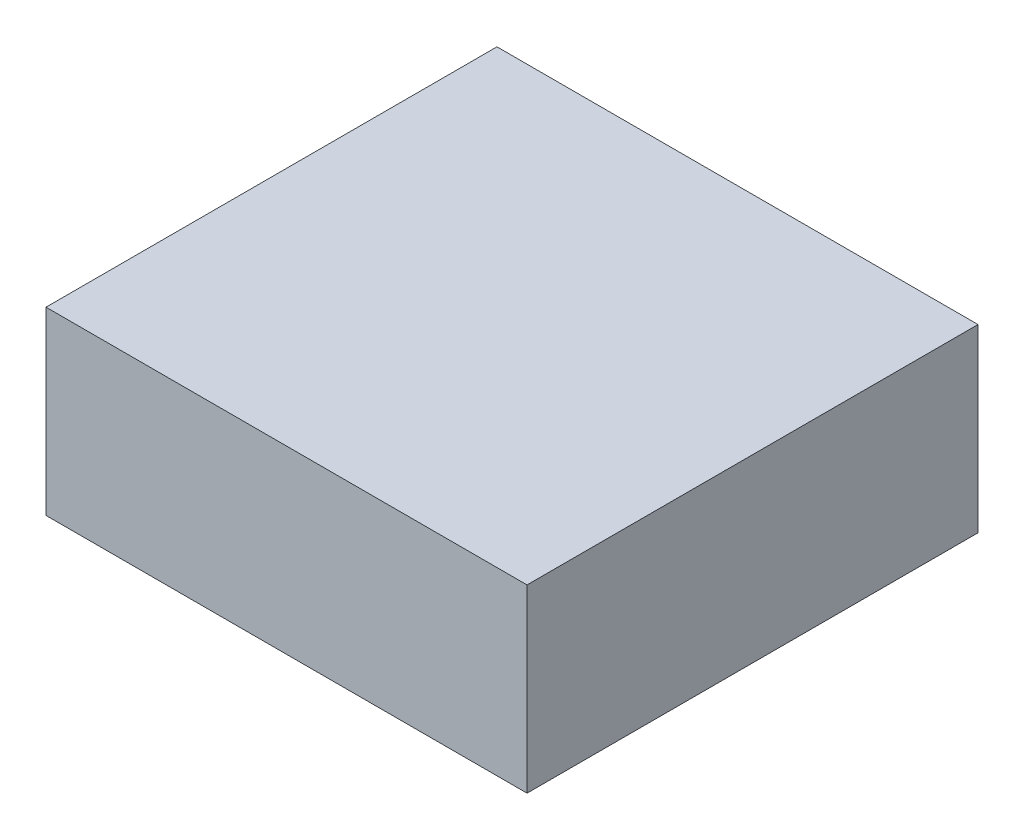
ISO-10303-21;
HEADER;
FILE_DESCRIPTION(('STEP AP214'),'2;1');
FILE_NAME('part.step','',(''),(''),'','','');
FILE_SCHEMA(('AUTOMOTIVE_DESIGN { 1 0 10303 214 1 1 1 1 }'));
ENDSEC;
DATA;
#1=APPLICATION_CONTEXT('core data for automotive mechanical design processes');
#2=APPLICATION_PROTOCOL_DEFINITION('international standard','automotive_design',2000,#1);
#3=PRODUCT_CONTEXT('',#1,'mechanical');
#4=PRODUCT('Part','Part','',(#3));
#5=PRODUCT_RELATED_PRODUCT_CATEGORY('part','',(#4));
#6=PRODUCT_DEFINITION_FORMATION('','',#4);
#7=PRODUCT_DEFINITION_CONTEXT('part definition',#1,'design');
#8=PRODUCT_DEFINITION('design','',#6,#7);
#9=PRODUCT_DEFINITION_SHAPE('','',#8);
#10=(LENGTH_UNIT() NAMED_UNIT(*) SI_UNIT(.MILLI.,.METRE.));
#11=(NAMED_UNIT(*) PLANE_ANGLE_UNIT() SI_UNIT($,.RADIAN.));
#12=(NAMED_UNIT(*) SI_UNIT($,.STERADIAN.) SOLID_ANGLE_UNIT());
#13=UNCERTAINTY_MEASURE_WITH_UNIT(LENGTH_MEASURE(1.E-05),#10,'distance_accuracy_value','');
#14=(GEOMETRIC_REPRESENTATION_CONTEXT(3) GLOBAL_UNCERTAINTY_ASSIGNED_CONTEXT((#13)) GLOBAL_UNIT_ASSIGNED_CONTEXT((#10,
#11,#12)) REPRESENTATION_CONTEXT('',''));
#15=CARTESIAN_POINT('',(0.,0.,0.));
#16=DIRECTION('',(0.,0.,1.));
#17=DIRECTION('',(1.,0.,0.));
#18=AXIS2_PLACEMENT_3D('',#15,#16,#17);
#19=CARTESIAN_POINT('',(-0.3999992,-0.1499997,0.));
#20=DIRECTION('',(0.,1.,0.));
#21=DIRECTION('',(0.,0.,1.));
#22=AXIS2_PLACEMENT_3D('',#19,#20,#21);
#23=PLANE('',#22);
#24=DIRECTION('',(0.,0.,1.));
#25=VECTOR('',#24,1.);
#26=CARTESIAN_POINT('',(0.40000174,-0.1499997,0.));
#27=LINE('',#26,#25);
#28=CARTESIAN_POINT('',(0.40000174,-0.1499997,0.));
#29=VERTEX_POINT('',#28);
#30=CARTESIAN_POINT('',(0.40000174,-0.1499997,0.75000104));
#31=VERTEX_POINT('',#30);
#32=EDGE_CURVE('E20',#29,#31,#27,.T.);
#33=ORIENTED_EDGE('',*,*,#32,.T.);
#34=DIRECTION('',(-1.,0.,0.));
#35=VECTOR('',#34,1.);
#36=CARTESIAN_POINT('',(0.40000174,-0.1499997,0.75000104));
#37=LINE('',#36,#35);
#38=CARTESIAN_POINT('',(-0.3999992,-0.1499997,0.75000104));
#39=VERTEX_POINT('',#38);
#40=EDGE_CURVE('E55',#31,#39,#37,.T.);
#41=ORIENTED_EDGE('',*,*,#40,.T.);
#42=DIRECTION('',(0.,0.,-1.));
#43=VECTOR('',#42,1.);
#44=CARTESIAN_POINT('',(-0.3999992,-0.1499997,0.));
#45=LINE('',#44,#43);
#46=CARTESIAN_POINT('',(-0.3999992,-0.1499997,0.));
#47=VERTEX_POINT('',#46);
#48=EDGE_CURVE('E76',#39,#47,#45,.T.);
#49=ORIENTED_EDGE('',*,*,#48,.T.);
#50=DIRECTION('',(-1.,0.,0.));
#51=VECTOR('',#50,1.);
#52=CARTESIAN_POINT('',(0.40000174,-0.1499997,0.));
#53=LINE('',#52,#51);
#54=EDGE_CURVE('E58',#29,#47,#53,.T.);
#55=ORIENTED_EDGE('',*,*,#54,.F.);
#56=EDGE_LOOP('',(#33,#41,#49,#55));
#57=FACE_BOUND('',#56,.T.);
#58=ADVANCED_FACE('F17',(#57),#23,.F.);
#59=CARTESIAN_POINT('',(0.40000174,-0.1499997,0.));
#60=DIRECTION('',(-1.,0.,0.));
#61=DIRECTION('',(0.,0.,1.));
#62=AXIS2_PLACEMENT_3D('',#59,#60,#61);
#63=PLANE('',#62);
#64=DIRECTION('',(0.,0.,-1.));
#65=VECTOR('',#64,1.);
#66=CARTESIAN_POINT('',(0.40000174,0.1499997,0.));
#67=LINE('',#66,#65);
#68=CARTESIAN_POINT('',(0.40000174,0.1499997,0.));
#69=VERTEX_POINT('',#68);
#70=CARTESIAN_POINT('',(0.40000174,0.1499997,0.75000104));
#71=VERTEX_POINT('',#70);
#72=EDGE_CURVE('E73',#69,#71,#67,.F.);
#73=ORIENTED_EDGE('',*,*,#72,.T.);
#74=DIRECTION('',(0.,1.,0.));
#75=VECTOR('',#74,1.);
#76=CARTESIAN_POINT('',(0.40000174,0.1499997,0.75000104));
#77=LINE('',#76,#75);
#78=EDGE_CURVE('E63',#71,#31,#77,.F.);
#79=ORIENTED_EDGE('',*,*,#78,.T.);
#80=ORIENTED_EDGE('',*,*,#32,.F.);
#81=DIRECTION('',(0.,1.,0.));
#82=VECTOR('',#81,1.);
#83=CARTESIAN_POINT('',(0.40000174,0.1499997,0.));
#84=LINE('',#83,#82);
#85=EDGE_CURVE('E78',#69,#29,#84,.F.);
#86=ORIENTED_EDGE('',*,*,#85,.F.);
#87=EDGE_LOOP('',(#73,#79,#80,#86));
#88=FACE_BOUND('',#87,.T.);
#89=ADVANCED_FACE('F72',(#88),#63,.F.);
#90=CARTESIAN_POINT('',(0.40000174,0.1499997,0.75000104));
#91=DIRECTION('',(0.,0.,-1.));
#92=DIRECTION('',(-1.,0.,0.));
#93=AXIS2_PLACEMENT_3D('',#90,#91,#92);
#94=PLANE('',#93);
#95=DIRECTION('',(0.,1.,0.));
#96=VECTOR('',#95,1.);
#97=CARTESIAN_POINT('',(-0.3999992,0.1499997,0.75000104));
#98=LINE('',#97,#96);
#99=CARTESIAN_POINT('',(-0.3999992,0.1499997,0.75000104));
#100=VERTEX_POINT('',#99);
#101=EDGE_CURVE('E69',#100,#39,#98,.F.);
#102=ORIENTED_EDGE('',*,*,#101,.T.);
#103=ORIENTED_EDGE('',*,*,#40,.F.);
#104=ORIENTED_EDGE('',*,*,#78,.F.);
#105=DIRECTION('',(1.,0.,0.));
#106=VECTOR('',#105,1.);
#107=CARTESIAN_POINT('',(0.40000174,0.1499997,0.75000104));
#108=LINE('',#107,#106);
#109=EDGE_CURVE('E83',#71,#100,#108,.F.);
#110=ORIENTED_EDGE('',*,*,#109,.T.);
#111=EDGE_LOOP('',(#102,#103,#104,#110));
#112=FACE_BOUND('',#111,.T.);
#113=ADVANCED_FACE('F66',(#112),#94,.F.);
#114=CARTESIAN_POINT('',(-0.3999992,0.1499997,0.));
#115=DIRECTION('',(1.,0.,0.));
#116=DIRECTION('',(0.,0.,-1.));
#117=AXIS2_PLACEMENT_3D('',#114,#115,#116);
#118=PLANE('',#117);
#119=ORIENTED_EDGE('',*,*,#48,.F.);
#120=ORIENTED_EDGE('',*,*,#101,.F.);
#121=DIRECTION('',(0.,0.,-1.));
#122=VECTOR('',#121,1.);
#123=CARTESIAN_POINT('',(-0.3999992,0.1499997,0.));
#124=LINE('',#123,#122);
#125=CARTESIAN_POINT('',(-0.3999992,0.1499997,0.));
#126=VERTEX_POINT('',#125);
#127=EDGE_CURVE('E26',#100,#126,#124,.T.);
#128=ORIENTED_EDGE('',*,*,#127,.T.);
#129=DIRECTION('',(0.,1.,0.));
#130=VECTOR('',#129,1.);
#131=CARTESIAN_POINT('',(-0.3999992,0.1499997,0.));
#132=LINE('',#131,#130);
#133=EDGE_CURVE('E34',#47,#126,#132,.T.);
#134=ORIENTED_EDGE('',*,*,#133,.F.);
#135=EDGE_LOOP('',(#119,#120,#128,#134));
#136=FACE_BOUND('',#135,.T.);
#137=ADVANCED_FACE('F88',(#136),#118,.F.);
#138=CARTESIAN_POINT('',(0.40000174,0.1499997,0.));
#139=DIRECTION('',(0.,0.,-1.));
#140=DIRECTION('',(-1.,0.,0.));
#141=AXIS2_PLACEMENT_3D('',#138,#139,#140);
#142=PLANE('',#141);
#143=ORIENTED_EDGE('',*,*,#133,.T.);
#144=DIRECTION('',(1.,0.,0.));
#145=VECTOR('',#144,1.);
#146=CARTESIAN_POINT('',(0.40000174,0.1499997,0.));
#147=LINE('',#146,#145);
#148=EDGE_CURVE('E11',#126,#69,#147,.T.);
#149=ORIENTED_EDGE('',*,*,#148,.T.);
#150=ORIENTED_EDGE('',*,*,#85,.T.);
#151=ORIENTED_EDGE('',*,*,#54,.T.);
#152=EDGE_LOOP('',(#143,#149,#150,#151));
#153=FACE_BOUND('',#152,.T.);
#154=ADVANCED_FACE('F91',(#153),#142,.T.);
#155=CARTESIAN_POINT('',(0.40000174,0.1499997,0.));
#156=DIRECTION('',(0.,-1.,0.));
#157=DIRECTION('',(0.,0.,-1.));
#158=AXIS2_PLACEMENT_3D('',#155,#156,#157);
#159=PLANE('',#158);
#160=ORIENTED_EDGE('',*,*,#127,.F.);
#161=ORIENTED_EDGE('',*,*,#109,.F.);
#162=ORIENTED_EDGE('',*,*,#72,.F.);
#163=ORIENTED_EDGE('',*,*,#148,.F.);
#164=EDGE_LOOP('',(#160,#161,#162,#163));
#165=FACE_BOUND('',#164,.T.);
#166=ADVANCED_FACE('F90',(#165),#159,.F.);
#167=CLOSED_SHELL('',(#58,#89,#113,#137,#154,#166));
#168=MANIFOLD_SOLID_BREP('B1',#167);
#169=ADVANCED_BREP_SHAPE_REPRESENTATION('',(#18,#168),#14);
#170=SHAPE_DEFINITION_REPRESENTATION(#9,#169);
ENDSEC;
END-ISO-10303-21;
